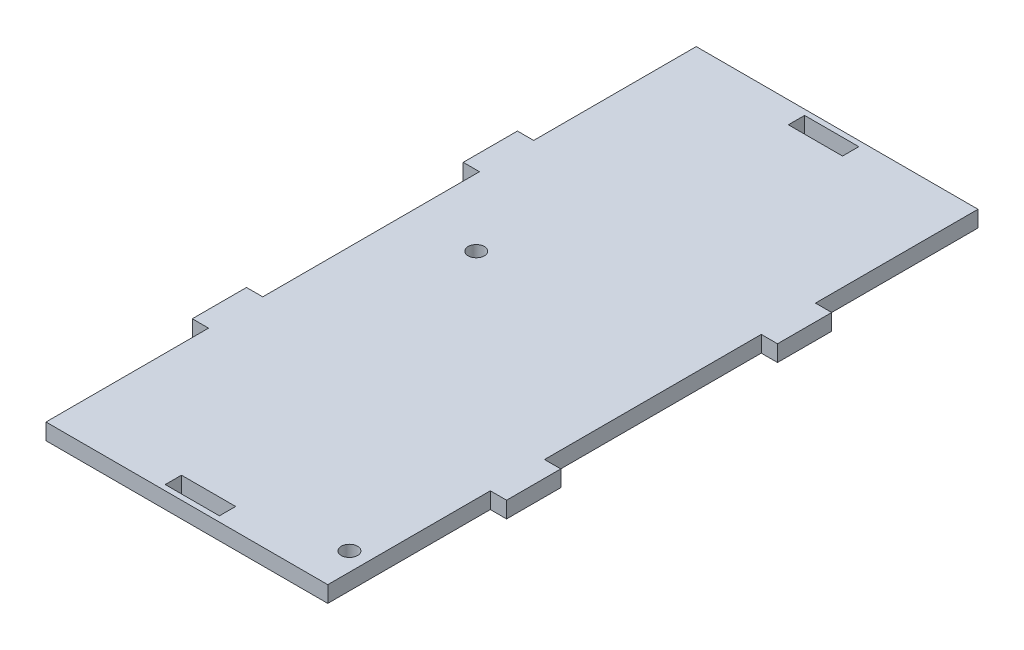
ISO-10303-21;
HEADER;
FILE_DESCRIPTION(('STEP AP214'),'2;1');
FILE_NAME('part.step','',(''),(''),'','','');
FILE_SCHEMA(('AUTOMOTIVE_DESIGN { 1 0 10303 214 1 1 1 1 }'));
ENDSEC;
DATA;
#1=APPLICATION_CONTEXT('core data for automotive mechanical design processes');
#2=APPLICATION_PROTOCOL_DEFINITION('international standard','automotive_design',2000,#1);
#3=PRODUCT_CONTEXT('',#1,'mechanical');
#4=PRODUCT('Part','Part','',(#3));
#5=PRODUCT_RELATED_PRODUCT_CATEGORY('part','',(#4));
#6=PRODUCT_DEFINITION_FORMATION('','',#4);
#7=PRODUCT_DEFINITION_CONTEXT('part definition',#1,'design');
#8=PRODUCT_DEFINITION('design','',#6,#7);
#9=PRODUCT_DEFINITION_SHAPE('','',#8);
#10=(LENGTH_UNIT() NAMED_UNIT(*) SI_UNIT(.MILLI.,.METRE.));
#11=(NAMED_UNIT(*) PLANE_ANGLE_UNIT() SI_UNIT($,.RADIAN.));
#12=(NAMED_UNIT(*) SI_UNIT($,.STERADIAN.) SOLID_ANGLE_UNIT());
#13=UNCERTAINTY_MEASURE_WITH_UNIT(LENGTH_MEASURE(1.E-05),#10,'distance_accuracy_value','');
#14=(GEOMETRIC_REPRESENTATION_CONTEXT(3) GLOBAL_UNCERTAINTY_ASSIGNED_CONTEXT((#13)) GLOBAL_UNIT_ASSIGNED_CONTEXT((#10,
#11,#12)) REPRESENTATION_CONTEXT('',''));
#15=CARTESIAN_POINT('',(0.,0.,0.));
#16=DIRECTION('',(0.,0.,1.));
#17=DIRECTION('',(1.,0.,0.));
#18=AXIS2_PLACEMENT_3D('',#15,#16,#17);
#19=CARTESIAN_POINT('',(0.,3.,0.));
#20=DIRECTION('',(0.,-1.,0.));
#21=DIRECTION('',(0.,0.,-1.));
#22=AXIS2_PLACEMENT_3D('',#19,#20,#21);
#23=PLANE('',#22);
#24=DIRECTION('',(0.,0.,1.));
#25=VECTOR('',#24,1.);
#26=CARTESIAN_POINT('',(-5.,3.,-59.));
#27=LINE('',#26,#25);
#28=CARTESIAN_POINT('',(-5.,3.,-59.));
#29=VERTEX_POINT('',#28);
#30=CARTESIAN_POINT('',(-5.,3.,-56.));
#31=VERTEX_POINT('',#30);
#32=EDGE_CURVE('E259',#29,#31,#27,.T.);
#33=ORIENTED_EDGE('',*,*,#32,.F.);
#34=DIRECTION('',(-1.,0.,0.));
#35=VECTOR('',#34,1.);
#36=CARTESIAN_POINT('',(5.,3.,-59.));
#37=LINE('',#36,#35);
#38=CARTESIAN_POINT('',(5.,3.,-59.));
#39=VERTEX_POINT('',#38);
#40=EDGE_CURVE('E267',#39,#29,#37,.T.);
#41=ORIENTED_EDGE('',*,*,#40,.F.);
#42=DIRECTION('',(0.,0.,-1.));
#43=VECTOR('',#42,1.);
#44=CARTESIAN_POINT('',(5.,3.,-59.));
#45=LINE('',#44,#43);
#46=CARTESIAN_POINT('',(5.,3.,-56.));
#47=VERTEX_POINT('',#46);
#48=EDGE_CURVE('E264',#47,#39,#45,.T.);
#49=ORIENTED_EDGE('',*,*,#48,.F.);
#50=DIRECTION('',(1.,0.,0.));
#51=VECTOR('',#50,1.);
#52=CARTESIAN_POINT('',(-5.,3.,-56.));
#53=LINE('',#52,#51);
#54=EDGE_CURVE('E261',#31,#47,#53,.T.);
#55=ORIENTED_EDGE('',*,*,#54,.F.);
#56=EDGE_LOOP('',(#33,#41,#49,#55));
#57=FACE_BOUND('',#56,.T.);
#58=DIRECTION('',(0.,0.,1.));
#59=VECTOR('',#58,1.);
#60=CARTESIAN_POINT('',(-26.,3.,-60.));
#61=LINE('',#60,#59);
#62=CARTESIAN_POINT('',(-26.,3.,-60.));
#63=VERTEX_POINT('',#62);
#64=CARTESIAN_POINT('',(-26.,3.,-30.));
#65=VERTEX_POINT('',#64);
#66=EDGE_CURVE('E290',#63,#65,#61,.T.);
#67=ORIENTED_EDGE('',*,*,#66,.T.);
#68=DIRECTION('',(-1.,0.,0.));
#69=VECTOR('',#68,1.);
#70=CARTESIAN_POINT('',(-26.,3.,-30.));
#71=LINE('',#70,#69);
#72=CARTESIAN_POINT('',(-29.,3.,-30.));
#73=VERTEX_POINT('',#72);
#74=EDGE_CURVE('E293',#65,#73,#71,.T.);
#75=ORIENTED_EDGE('',*,*,#74,.T.);
#76=DIRECTION('',(0.,0.,1.));
#77=VECTOR('',#76,1.);
#78=CARTESIAN_POINT('',(-29.,3.,-30.));
#79=LINE('',#78,#77);
#80=CARTESIAN_POINT('',(-29.,3.,-20.));
#81=VERTEX_POINT('',#80);
#82=EDGE_CURVE('E296',#73,#81,#79,.T.);
#83=ORIENTED_EDGE('',*,*,#82,.T.);
#84=DIRECTION('',(1.,0.,0.));
#85=VECTOR('',#84,1.);
#86=CARTESIAN_POINT('',(-26.,3.,-20.));
#87=LINE('',#86,#85);
#88=CARTESIAN_POINT('',(-26.,3.,-20.));
#89=VERTEX_POINT('',#88);
#90=EDGE_CURVE('E298',#81,#89,#87,.T.);
#91=ORIENTED_EDGE('',*,*,#90,.T.);
#92=DIRECTION('',(0.,0.,1.));
#93=VECTOR('',#92,1.);
#94=CARTESIAN_POINT('',(-26.,3.,20.));
#95=LINE('',#94,#93);
#96=CARTESIAN_POINT('',(-26.,3.,20.));
#97=VERTEX_POINT('',#96);
#98=EDGE_CURVE('E300',#89,#97,#95,.T.);
#99=ORIENTED_EDGE('',*,*,#98,.T.);
#100=DIRECTION('',(-1.,0.,0.));
#101=VECTOR('',#100,1.);
#102=CARTESIAN_POINT('',(-26.,3.,20.));
#103=LINE('',#102,#101);
#104=CARTESIAN_POINT('',(-29.,3.,20.));
#105=VERTEX_POINT('',#104);
#106=EDGE_CURVE('E302',#97,#105,#103,.T.);
#107=ORIENTED_EDGE('',*,*,#106,.T.);
#108=DIRECTION('',(0.,0.,1.));
#109=VECTOR('',#108,1.);
#110=CARTESIAN_POINT('',(-29.,3.,30.));
#111=LINE('',#110,#109);
#112=CARTESIAN_POINT('',(-29.,3.,30.));
#113=VERTEX_POINT('',#112);
#114=EDGE_CURVE('E304',#105,#113,#111,.T.);
#115=ORIENTED_EDGE('',*,*,#114,.T.);
#116=DIRECTION('',(1.,0.,0.));
#117=VECTOR('',#116,1.);
#118=CARTESIAN_POINT('',(-26.,3.,30.));
#119=LINE('',#118,#117);
#120=CARTESIAN_POINT('',(-26.,3.,30.));
#121=VERTEX_POINT('',#120);
#122=EDGE_CURVE('E306',#113,#121,#119,.T.);
#123=ORIENTED_EDGE('',*,*,#122,.T.);
#124=DIRECTION('',(0.,0.,1.));
#125=VECTOR('',#124,1.);
#126=CARTESIAN_POINT('',(-26.,3.,30.));
#127=LINE('',#126,#125);
#128=CARTESIAN_POINT('',(-26.,3.,60.));
#129=VERTEX_POINT('',#128);
#130=EDGE_CURVE('E308',#121,#129,#127,.T.);
#131=ORIENTED_EDGE('',*,*,#130,.T.);
#132=DIRECTION('',(1.,0.,0.));
#133=VECTOR('',#132,1.);
#134=CARTESIAN_POINT('',(-26.,3.,60.));
#135=LINE('',#134,#133);
#136=CARTESIAN_POINT('',(26.,3.,60.));
#137=VERTEX_POINT('',#136);
#138=EDGE_CURVE('E310',#129,#137,#135,.T.);
#139=ORIENTED_EDGE('',*,*,#138,.T.);
#140=DIRECTION('',(0.,0.,-1.));
#141=VECTOR('',#140,1.);
#142=CARTESIAN_POINT('',(26.,3.,30.));
#143=LINE('',#142,#141);
#144=CARTESIAN_POINT('',(26.,3.,30.));
#145=VERTEX_POINT('',#144);
#146=EDGE_CURVE('E312',#137,#145,#143,.T.);
#147=ORIENTED_EDGE('',*,*,#146,.T.);
#148=DIRECTION('',(1.,0.,0.));
#149=VECTOR('',#148,1.);
#150=CARTESIAN_POINT('',(26.,3.,30.));
#151=LINE('',#150,#149);
#152=CARTESIAN_POINT('',(29.,3.,30.));
#153=VERTEX_POINT('',#152);
#154=EDGE_CURVE('E314',#145,#153,#151,.T.);
#155=ORIENTED_EDGE('',*,*,#154,.T.);
#156=DIRECTION('',(0.,0.,-1.));
#157=VECTOR('',#156,1.);
#158=CARTESIAN_POINT('',(29.,3.,30.));
#159=LINE('',#158,#157);
#160=CARTESIAN_POINT('',(29.,3.,20.));
#161=VERTEX_POINT('',#160);
#162=EDGE_CURVE('E316',#153,#161,#159,.T.);
#163=ORIENTED_EDGE('',*,*,#162,.T.);
#164=DIRECTION('',(-1.,0.,0.));
#165=VECTOR('',#164,1.);
#166=CARTESIAN_POINT('',(26.,3.,20.));
#167=LINE('',#166,#165);
#168=CARTESIAN_POINT('',(26.,3.,20.));
#169=VERTEX_POINT('',#168);
#170=EDGE_CURVE('E318',#161,#169,#167,.T.);
#171=ORIENTED_EDGE('',*,*,#170,.T.);
#172=DIRECTION('',(0.,0.,-1.));
#173=VECTOR('',#172,1.);
#174=CARTESIAN_POINT('',(26.,3.,20.));
#175=LINE('',#174,#173);
#176=CARTESIAN_POINT('',(26.,3.,-20.));
#177=VERTEX_POINT('',#176);
#178=EDGE_CURVE('E320',#169,#177,#175,.T.);
#179=ORIENTED_EDGE('',*,*,#178,.T.);
#180=DIRECTION('',(1.,0.,0.));
#181=VECTOR('',#180,1.);
#182=CARTESIAN_POINT('',(26.,3.,-20.));
#183=LINE('',#182,#181);
#184=CARTESIAN_POINT('',(29.,3.,-20.));
#185=VERTEX_POINT('',#184);
#186=EDGE_CURVE('E322',#177,#185,#183,.T.);
#187=ORIENTED_EDGE('',*,*,#186,.T.);
#188=DIRECTION('',(0.,0.,-1.));
#189=VECTOR('',#188,1.);
#190=CARTESIAN_POINT('',(29.,3.,-30.));
#191=LINE('',#190,#189);
#192=CARTESIAN_POINT('',(29.,3.,-30.));
#193=VERTEX_POINT('',#192);
#194=EDGE_CURVE('E324',#185,#193,#191,.T.);
#195=ORIENTED_EDGE('',*,*,#194,.T.);
#196=DIRECTION('',(-1.,0.,0.));
#197=VECTOR('',#196,1.);
#198=CARTESIAN_POINT('',(26.,3.,-30.));
#199=LINE('',#198,#197);
#200=CARTESIAN_POINT('',(26.,3.,-30.));
#201=VERTEX_POINT('',#200);
#202=EDGE_CURVE('E326',#193,#201,#199,.T.);
#203=ORIENTED_EDGE('',*,*,#202,.T.);
#204=DIRECTION('',(0.,0.,-1.));
#205=VECTOR('',#204,1.);
#206=CARTESIAN_POINT('',(26.,3.,-60.));
#207=LINE('',#206,#205);
#208=CARTESIAN_POINT('',(26.,3.,-60.));
#209=VERTEX_POINT('',#208);
#210=EDGE_CURVE('E328',#201,#209,#207,.T.);
#211=ORIENTED_EDGE('',*,*,#210,.T.);
#212=DIRECTION('',(-1.,0.,0.));
#213=VECTOR('',#212,1.);
#214=CARTESIAN_POINT('',(-26.,3.,-60.));
#215=LINE('',#214,#213);
#216=EDGE_CURVE('E330',#209,#63,#215,.T.);
#217=ORIENTED_EDGE('',*,*,#216,.T.);
#218=EDGE_LOOP('',(#67,#75,#83,#91,#99,#107,#115,#123,#131,#139,#147,#155,#163,#171,#179,#187,
#195,#203,#211,#217));
#219=FACE_BOUND('',#218,.T.);
#220=DIRECTION('',(0.,0.,-1.));
#221=VECTOR('',#220,1.);
#222=CARTESIAN_POINT('',(5.,3.,59.));
#223=LINE('',#222,#221);
#224=CARTESIAN_POINT('',(5.,3.,59.));
#225=VERTEX_POINT('',#224);
#226=CARTESIAN_POINT('',(5.,3.,56.));
#227=VERTEX_POINT('',#226);
#228=EDGE_CURVE('E220',#225,#227,#223,.T.);
#229=ORIENTED_EDGE('',*,*,#228,.F.);
#230=DIRECTION('',(1.,0.,0.));
#231=VECTOR('',#230,1.);
#232=CARTESIAN_POINT('',(-5.,3.,59.));
#233=LINE('',#232,#231);
#234=CARTESIAN_POINT('',(-5.,3.,59.));
#235=VERTEX_POINT('',#234);
#236=EDGE_CURVE('E243',#235,#225,#233,.T.);
#237=ORIENTED_EDGE('',*,*,#236,.F.);
#238=DIRECTION('',(0.,0.,1.));
#239=VECTOR('',#238,1.);
#240=CARTESIAN_POINT('',(-5.,3.,59.));
#241=LINE('',#240,#239);
#242=CARTESIAN_POINT('',(-5.,3.,56.));
#243=VERTEX_POINT('',#242);
#244=EDGE_CURVE('E241',#243,#235,#241,.T.);
#245=ORIENTED_EDGE('',*,*,#244,.F.);
#246=DIRECTION('',(-1.,0.,0.));
#247=VECTOR('',#246,1.);
#248=CARTESIAN_POINT('',(-5.,3.,56.));
#249=LINE('',#248,#247);
#250=EDGE_CURVE('E228',#227,#243,#249,.T.);
#251=ORIENTED_EDGE('',*,*,#250,.F.);
#252=EDGE_LOOP('',(#229,#237,#245,#251));
#253=FACE_BOUND('',#252,.T.);
#254=CARTESIAN_POINT('',(22.6,3.,52.6));
#255=DIRECTION('',(0.,1.,0.));
#256=DIRECTION('',(0.,0.,1.));
#257=AXIS2_PLACEMENT_3D('',#254,#255,#256);
#258=CIRCLE('',#257,1.5);
#259=CARTESIAN_POINT('',(22.6,3.,54.1));
#260=VERTEX_POINT('',#259);
#261=EDGE_CURVE('E249',#260,#260,#258,.T.);
#262=ORIENTED_EDGE('',*,*,#261,.F.);
#263=EDGE_LOOP('',(#262));
#264=FACE_BOUND('',#263,.T.);
#265=CARTESIAN_POINT('',(-13.6,3.,-7.));
#266=DIRECTION('',(0.,1.,0.));
#267=DIRECTION('',(0.,0.,1.));
#268=AXIS2_PLACEMENT_3D('',#265,#266,#267);
#269=CIRCLE('',#268,1.5);
#270=CARTESIAN_POINT('',(-13.6,3.,-5.5));
#271=VERTEX_POINT('',#270);
#272=EDGE_CURVE('E801',#271,#271,#269,.T.);
#273=ORIENTED_EDGE('',*,*,#272,.F.);
#274=EDGE_LOOP('',(#273));
#275=FACE_BOUND('',#274,.T.);
#276=ADVANCED_FACE('F35',(#57,#219,#253,#264,#275),#23,.F.);
#277=CARTESIAN_POINT('',(0.,0.,0.));
#278=DIRECTION('',(0.,-1.,0.));
#279=DIRECTION('',(0.,0.,-1.));
#280=AXIS2_PLACEMENT_3D('',#277,#278,#279);
#281=PLANE('',#280);
#282=CARTESIAN_POINT('',(22.6,0.,52.6));
#283=DIRECTION('',(0.,1.,0.));
#284=DIRECTION('',(0.,0.,1.));
#285=AXIS2_PLACEMENT_3D('',#282,#283,#284);
#286=CIRCLE('',#285,1.5);
#287=CARTESIAN_POINT('',(22.6,0.,54.1));
#288=VERTEX_POINT('',#287);
#289=EDGE_CURVE('E807',#288,#288,#286,.T.);
#290=ORIENTED_EDGE('',*,*,#289,.T.);
#291=EDGE_LOOP('',(#290));
#292=FACE_BOUND('',#291,.T.);
#293=DIRECTION('',(0.,0.,1.));
#294=VECTOR('',#293,1.);
#295=CARTESIAN_POINT('',(-26.,0.,-60.));
#296=LINE('',#295,#294);
#297=CARTESIAN_POINT('',(-26.,0.,-60.));
#298=VERTEX_POINT('',#297);
#299=CARTESIAN_POINT('',(-26.,0.,-30.));
#300=VERTEX_POINT('',#299);
#301=EDGE_CURVE('E289',#298,#300,#296,.T.);
#302=ORIENTED_EDGE('',*,*,#301,.F.);
#303=DIRECTION('',(-1.,0.,0.));
#304=VECTOR('',#303,1.);
#305=CARTESIAN_POINT('',(-26.,0.,-60.));
#306=LINE('',#305,#304);
#307=CARTESIAN_POINT('',(26.,0.,-60.));
#308=VERTEX_POINT('',#307);
#309=EDGE_CURVE('E294',#308,#298,#306,.T.);
#310=ORIENTED_EDGE('',*,*,#309,.F.);
#311=DIRECTION('',(0.,0.,-1.));
#312=VECTOR('',#311,1.);
#313=CARTESIAN_POINT('',(26.,0.,-60.));
#314=LINE('',#313,#312);
#315=CARTESIAN_POINT('',(26.,0.,-30.));
#316=VERTEX_POINT('',#315);
#317=EDGE_CURVE('E369',#316,#308,#314,.T.);
#318=ORIENTED_EDGE('',*,*,#317,.F.);
#319=DIRECTION('',(-1.,0.,0.));
#320=VECTOR('',#319,1.);
#321=CARTESIAN_POINT('',(26.,0.,-30.));
#322=LINE('',#321,#320);
#323=CARTESIAN_POINT('',(29.,0.,-30.));
#324=VERTEX_POINT('',#323);
#325=EDGE_CURVE('E367',#324,#316,#322,.T.);
#326=ORIENTED_EDGE('',*,*,#325,.F.);
#327=DIRECTION('',(0.,0.,-1.));
#328=VECTOR('',#327,1.);
#329=CARTESIAN_POINT('',(29.,0.,-30.));
#330=LINE('',#329,#328);
#331=CARTESIAN_POINT('',(29.,0.,-20.));
#332=VERTEX_POINT('',#331);
#333=EDGE_CURVE('E365',#332,#324,#330,.T.);
#334=ORIENTED_EDGE('',*,*,#333,.F.);
#335=DIRECTION('',(1.,0.,0.));
#336=VECTOR('',#335,1.);
#337=CARTESIAN_POINT('',(26.,0.,-20.));
#338=LINE('',#337,#336);
#339=CARTESIAN_POINT('',(26.,0.,-20.));
#340=VERTEX_POINT('',#339);
#341=EDGE_CURVE('E363',#340,#332,#338,.T.);
#342=ORIENTED_EDGE('',*,*,#341,.F.);
#343=DIRECTION('',(0.,0.,-1.));
#344=VECTOR('',#343,1.);
#345=CARTESIAN_POINT('',(26.,0.,20.));
#346=LINE('',#345,#344);
#347=CARTESIAN_POINT('',(26.,0.,20.));
#348=VERTEX_POINT('',#347);
#349=EDGE_CURVE('E361',#348,#340,#346,.T.);
#350=ORIENTED_EDGE('',*,*,#349,.F.);
#351=DIRECTION('',(-1.,0.,0.));
#352=VECTOR('',#351,1.);
#353=CARTESIAN_POINT('',(26.,0.,20.));
#354=LINE('',#353,#352);
#355=CARTESIAN_POINT('',(29.,0.,20.));
#356=VERTEX_POINT('',#355);
#357=EDGE_CURVE('E359',#356,#348,#354,.T.);
#358=ORIENTED_EDGE('',*,*,#357,.F.);
#359=DIRECTION('',(0.,0.,-1.));
#360=VECTOR('',#359,1.);
#361=CARTESIAN_POINT('',(29.,0.,30.));
#362=LINE('',#361,#360);
#363=CARTESIAN_POINT('',(29.,0.,30.));
#364=VERTEX_POINT('',#363);
#365=EDGE_CURVE('E357',#364,#356,#362,.T.);
#366=ORIENTED_EDGE('',*,*,#365,.F.);
#367=DIRECTION('',(1.,0.,0.));
#368=VECTOR('',#367,1.);
#369=CARTESIAN_POINT('',(26.,0.,30.));
#370=LINE('',#369,#368);
#371=CARTESIAN_POINT('',(26.,0.,30.));
#372=VERTEX_POINT('',#371);
#373=EDGE_CURVE('E355',#372,#364,#370,.T.);
#374=ORIENTED_EDGE('',*,*,#373,.F.);
#375=DIRECTION('',(0.,0.,-1.));
#376=VECTOR('',#375,1.);
#377=CARTESIAN_POINT('',(26.,0.,30.));
#378=LINE('',#377,#376);
#379=CARTESIAN_POINT('',(26.,0.,60.));
#380=VERTEX_POINT('',#379);
#381=EDGE_CURVE('E353',#380,#372,#378,.T.);
#382=ORIENTED_EDGE('',*,*,#381,.F.);
#383=DIRECTION('',(1.,0.,0.));
#384=VECTOR('',#383,1.);
#385=CARTESIAN_POINT('',(-26.,0.,60.));
#386=LINE('',#385,#384);
#387=CARTESIAN_POINT('',(-26.,0.,60.));
#388=VERTEX_POINT('',#387);
#389=EDGE_CURVE('E351',#388,#380,#386,.T.);
#390=ORIENTED_EDGE('',*,*,#389,.F.);
#391=DIRECTION('',(0.,0.,1.));
#392=VECTOR('',#391,1.);
#393=CARTESIAN_POINT('',(-26.,0.,30.));
#394=LINE('',#393,#392);
#395=CARTESIAN_POINT('',(-26.,0.,30.));
#396=VERTEX_POINT('',#395);
#397=EDGE_CURVE('E349',#396,#388,#394,.T.);
#398=ORIENTED_EDGE('',*,*,#397,.F.);
#399=DIRECTION('',(1.,0.,0.));
#400=VECTOR('',#399,1.);
#401=CARTESIAN_POINT('',(-26.,0.,30.));
#402=LINE('',#401,#400);
#403=CARTESIAN_POINT('',(-29.,0.,30.));
#404=VERTEX_POINT('',#403);
#405=EDGE_CURVE('E347',#404,#396,#402,.T.);
#406=ORIENTED_EDGE('',*,*,#405,.F.);
#407=DIRECTION('',(0.,0.,1.));
#408=VECTOR('',#407,1.);
#409=CARTESIAN_POINT('',(-29.,0.,30.));
#410=LINE('',#409,#408);
#411=CARTESIAN_POINT('',(-29.,0.,20.));
#412=VERTEX_POINT('',#411);
#413=EDGE_CURVE('E345',#412,#404,#410,.T.);
#414=ORIENTED_EDGE('',*,*,#413,.F.);
#415=DIRECTION('',(-1.,0.,0.));
#416=VECTOR('',#415,1.);
#417=CARTESIAN_POINT('',(-26.,0.,20.));
#418=LINE('',#417,#416);
#419=CARTESIAN_POINT('',(-26.,0.,20.));
#420=VERTEX_POINT('',#419);
#421=EDGE_CURVE('E343',#420,#412,#418,.T.);
#422=ORIENTED_EDGE('',*,*,#421,.F.);
#423=DIRECTION('',(0.,0.,1.));
#424=VECTOR('',#423,1.);
#425=CARTESIAN_POINT('',(-26.,0.,20.));
#426=LINE('',#425,#424);
#427=CARTESIAN_POINT('',(-26.,0.,-20.));
#428=VERTEX_POINT('',#427);
#429=EDGE_CURVE('E341',#428,#420,#426,.T.);
#430=ORIENTED_EDGE('',*,*,#429,.F.);
#431=DIRECTION('',(1.,0.,0.));
#432=VECTOR('',#431,1.);
#433=CARTESIAN_POINT('',(-26.,0.,-20.));
#434=LINE('',#433,#432);
#435=CARTESIAN_POINT('',(-29.,0.,-20.));
#436=VERTEX_POINT('',#435);
#437=EDGE_CURVE('E339',#436,#428,#434,.T.);
#438=ORIENTED_EDGE('',*,*,#437,.F.);
#439=DIRECTION('',(0.,0.,1.));
#440=VECTOR('',#439,1.);
#441=CARTESIAN_POINT('',(-29.,0.,-30.));
#442=LINE('',#441,#440);
#443=CARTESIAN_POINT('',(-29.,0.,-30.));
#444=VERTEX_POINT('',#443);
#445=EDGE_CURVE('E337',#444,#436,#442,.T.);
#446=ORIENTED_EDGE('',*,*,#445,.F.);
#447=DIRECTION('',(-1.,0.,0.));
#448=VECTOR('',#447,1.);
#449=CARTESIAN_POINT('',(-26.,0.,-30.));
#450=LINE('',#449,#448);
#451=EDGE_CURVE('E335',#300,#444,#450,.T.);
#452=ORIENTED_EDGE('',*,*,#451,.F.);
#453=EDGE_LOOP('',(#302,#310,#318,#326,#334,#342,#350,#358,#366,#374,#382,#390,#398,#406,#414,
#422,#430,#438,#446,#452));
#454=FACE_BOUND('',#453,.T.);
#455=DIRECTION('',(-1.,0.,0.));
#456=VECTOR('',#455,1.);
#457=CARTESIAN_POINT('',(5.,0.,-59.));
#458=LINE('',#457,#456);
#459=CARTESIAN_POINT('',(5.,0.,-59.));
#460=VERTEX_POINT('',#459);
#461=CARTESIAN_POINT('',(-5.,0.,-59.));
#462=VERTEX_POINT('',#461);
#463=EDGE_CURVE('E262',#460,#462,#458,.T.);
#464=ORIENTED_EDGE('',*,*,#463,.T.);
#465=DIRECTION('',(0.,0.,1.));
#466=VECTOR('',#465,1.);
#467=CARTESIAN_POINT('',(-5.,0.,-59.));
#468=LINE('',#467,#466);
#469=CARTESIAN_POINT('',(-5.,0.,-56.));
#470=VERTEX_POINT('',#469);
#471=EDGE_CURVE('E236',#462,#470,#468,.T.);
#472=ORIENTED_EDGE('',*,*,#471,.T.);
#473=DIRECTION('',(1.,0.,0.));
#474=VECTOR('',#473,1.);
#475=CARTESIAN_POINT('',(-5.,0.,-56.));
#476=LINE('',#475,#474);
#477=CARTESIAN_POINT('',(5.,0.,-56.));
#478=VERTEX_POINT('',#477);
#479=EDGE_CURVE('E272',#470,#478,#476,.T.);
#480=ORIENTED_EDGE('',*,*,#479,.T.);
#481=DIRECTION('',(0.,0.,-1.));
#482=VECTOR('',#481,1.);
#483=CARTESIAN_POINT('',(5.,0.,-59.));
#484=LINE('',#483,#482);
#485=EDGE_CURVE('E275',#478,#460,#484,.T.);
#486=ORIENTED_EDGE('',*,*,#485,.T.);
#487=EDGE_LOOP('',(#464,#472,#480,#486));
#488=FACE_BOUND('',#487,.T.);
#489=DIRECTION('',(1.,0.,0.));
#490=VECTOR('',#489,1.);
#491=CARTESIAN_POINT('',(-5.,0.,59.));
#492=LINE('',#491,#490);
#493=CARTESIAN_POINT('',(-5.,0.,59.));
#494=VERTEX_POINT('',#493);
#495=CARTESIAN_POINT('',(5.,0.,59.));
#496=VERTEX_POINT('',#495);
#497=EDGE_CURVE('E229',#494,#496,#492,.T.);
#498=ORIENTED_EDGE('',*,*,#497,.T.);
#499=DIRECTION('',(0.,0.,-1.));
#500=VECTOR('',#499,1.);
#501=CARTESIAN_POINT('',(5.,0.,59.));
#502=LINE('',#501,#500);
#503=CARTESIAN_POINT('',(5.,0.,56.));
#504=VERTEX_POINT('',#503);
#505=EDGE_CURVE('E58',#496,#504,#502,.T.);
#506=ORIENTED_EDGE('',*,*,#505,.T.);
#507=DIRECTION('',(-1.,0.,0.));
#508=VECTOR('',#507,1.);
#509=CARTESIAN_POINT('',(-5.,0.,56.));
#510=LINE('',#509,#508);
#511=CARTESIAN_POINT('',(-5.,0.,56.));
#512=VERTEX_POINT('',#511);
#513=EDGE_CURVE('E235',#504,#512,#510,.T.);
#514=ORIENTED_EDGE('',*,*,#513,.T.);
#515=DIRECTION('',(0.,0.,1.));
#516=VECTOR('',#515,1.);
#517=CARTESIAN_POINT('',(-5.,0.,59.));
#518=LINE('',#517,#516);
#519=EDGE_CURVE('E251',#512,#494,#518,.T.);
#520=ORIENTED_EDGE('',*,*,#519,.T.);
#521=EDGE_LOOP('',(#498,#506,#514,#520));
#522=FACE_BOUND('',#521,.T.);
#523=CARTESIAN_POINT('',(-13.6,0.,-7.));
#524=DIRECTION('',(0.,1.,0.));
#525=DIRECTION('',(0.,0.,1.));
#526=AXIS2_PLACEMENT_3D('',#523,#524,#525);
#527=CIRCLE('',#526,1.5);
#528=CARTESIAN_POINT('',(-13.6,0.,-5.5));
#529=VERTEX_POINT('',#528);
#530=EDGE_CURVE('E804',#529,#529,#527,.T.);
#531=ORIENTED_EDGE('',*,*,#530,.T.);
#532=EDGE_LOOP('',(#531));
#533=FACE_BOUND('',#532,.T.);
#534=ADVANCED_FACE('F435',(#292,#454,#488,#522,#533),#281,.T.);
#535=CARTESIAN_POINT('',(-26.,3.,-60.));
#536=DIRECTION('',(1.,0.,0.));
#537=DIRECTION('',(0.,0.,-1.));
#538=AXIS2_PLACEMENT_3D('',#535,#536,#537);
#539=PLANE('',#538);
#540=ORIENTED_EDGE('',*,*,#301,.T.);
#541=DIRECTION('',(0.,-1.,0.));
#542=VECTOR('',#541,1.);
#543=CARTESIAN_POINT('',(-26.,3.,-30.));
#544=LINE('',#543,#542);
#545=EDGE_CURVE('E11',#65,#300,#544,.T.);
#546=ORIENTED_EDGE('',*,*,#545,.F.);
#547=ORIENTED_EDGE('',*,*,#66,.F.);
#548=DIRECTION('',(0.,-1.,0.));
#549=VECTOR('',#548,1.);
#550=CARTESIAN_POINT('',(-26.,3.,-60.));
#551=LINE('',#550,#549);
#552=EDGE_CURVE('E332',#63,#298,#551,.T.);
#553=ORIENTED_EDGE('',*,*,#552,.T.);
#554=EDGE_LOOP('',(#540,#546,#547,#553));
#555=FACE_BOUND('',#554,.T.);
#556=ADVANCED_FACE('F37',(#555),#539,.F.);
#557=CARTESIAN_POINT('',(-26.,3.,-30.));
#558=DIRECTION('',(0.,0.,1.));
#559=DIRECTION('',(1.,0.,0.));
#560=AXIS2_PLACEMENT_3D('',#557,#558,#559);
#561=PLANE('',#560);
#562=ORIENTED_EDGE('',*,*,#451,.T.);
#563=DIRECTION('',(0.,-1.,0.));
#564=VECTOR('',#563,1.);
#565=CARTESIAN_POINT('',(-29.,3.,-30.));
#566=LINE('',#565,#564);
#567=EDGE_CURVE('E43',#73,#444,#566,.T.);
#568=ORIENTED_EDGE('',*,*,#567,.F.);
#569=ORIENTED_EDGE('',*,*,#74,.F.);
#570=ORIENTED_EDGE('',*,*,#545,.T.);
#571=EDGE_LOOP('',(#562,#568,#569,#570));
#572=FACE_BOUND('',#571,.T.);
#573=ADVANCED_FACE('F452',(#572),#561,.F.);
#574=CARTESIAN_POINT('',(-29.,3.,-30.));
#575=DIRECTION('',(1.,0.,0.));
#576=DIRECTION('',(0.,0.,-1.));
#577=AXIS2_PLACEMENT_3D('',#574,#575,#576);
#578=PLANE('',#577);
#579=ORIENTED_EDGE('',*,*,#445,.T.);
#580=DIRECTION('',(0.,-1.,0.));
#581=VECTOR('',#580,1.);
#582=CARTESIAN_POINT('',(-29.,3.,-20.));
#583=LINE('',#582,#581);
#584=EDGE_CURVE('E422',#81,#436,#583,.T.);
#585=ORIENTED_EDGE('',*,*,#584,.F.);
#586=ORIENTED_EDGE('',*,*,#82,.F.);
#587=ORIENTED_EDGE('',*,*,#567,.T.);
#588=EDGE_LOOP('',(#579,#585,#586,#587));
#589=FACE_BOUND('',#588,.T.);
#590=ADVANCED_FACE('F429',(#589),#578,.F.);
#591=CARTESIAN_POINT('',(-26.,3.,-20.));
#592=DIRECTION('',(0.,0.,-1.));
#593=DIRECTION('',(-1.,0.,0.));
#594=AXIS2_PLACEMENT_3D('',#591,#592,#593);
#595=PLANE('',#594);
#596=ORIENTED_EDGE('',*,*,#437,.T.);
#597=DIRECTION('',(0.,-1.,0.));
#598=VECTOR('',#597,1.);
#599=CARTESIAN_POINT('',(-26.,3.,-20.));
#600=LINE('',#599,#598);
#601=EDGE_CURVE('E419',#89,#428,#600,.T.);
#602=ORIENTED_EDGE('',*,*,#601,.F.);
#603=ORIENTED_EDGE('',*,*,#90,.F.);
#604=ORIENTED_EDGE('',*,*,#584,.T.);
#605=EDGE_LOOP('',(#596,#602,#603,#604));
#606=FACE_BOUND('',#605,.T.);
#607=ADVANCED_FACE('F441',(#606),#595,.F.);
#608=CARTESIAN_POINT('',(-26.,3.,20.));
#609=DIRECTION('',(1.,0.,0.));
#610=DIRECTION('',(0.,0.,-1.));
#611=AXIS2_PLACEMENT_3D('',#608,#609,#610);
#612=PLANE('',#611);
#613=ORIENTED_EDGE('',*,*,#429,.T.);
#614=DIRECTION('',(0.,-1.,0.));
#615=VECTOR('',#614,1.);
#616=CARTESIAN_POINT('',(-26.,3.,20.));
#617=LINE('',#616,#615);
#618=EDGE_CURVE('E416',#97,#420,#617,.T.);
#619=ORIENTED_EDGE('',*,*,#618,.F.);
#620=ORIENTED_EDGE('',*,*,#98,.F.);
#621=ORIENTED_EDGE('',*,*,#601,.T.);
#622=EDGE_LOOP('',(#613,#619,#620,#621));
#623=FACE_BOUND('',#622,.T.);
#624=ADVANCED_FACE('F445',(#623),#612,.F.);
#625=CARTESIAN_POINT('',(-26.,3.,20.));
#626=DIRECTION('',(0.,0.,1.));
#627=DIRECTION('',(1.,0.,0.));
#628=AXIS2_PLACEMENT_3D('',#625,#626,#627);
#629=PLANE('',#628);
#630=ORIENTED_EDGE('',*,*,#421,.T.);
#631=DIRECTION('',(0.,-1.,0.));
#632=VECTOR('',#631,1.);
#633=CARTESIAN_POINT('',(-29.,3.,20.));
#634=LINE('',#633,#632);
#635=EDGE_CURVE('E413',#105,#412,#634,.T.);
#636=ORIENTED_EDGE('',*,*,#635,.F.);
#637=ORIENTED_EDGE('',*,*,#106,.F.);
#638=ORIENTED_EDGE('',*,*,#618,.T.);
#639=EDGE_LOOP('',(#630,#636,#637,#638));
#640=FACE_BOUND('',#639,.T.);
#641=ADVANCED_FACE('F525',(#640),#629,.F.);
#642=CARTESIAN_POINT('',(-29.,3.,30.));
#643=DIRECTION('',(1.,0.,0.));
#644=DIRECTION('',(0.,0.,-1.));
#645=AXIS2_PLACEMENT_3D('',#642,#643,#644);
#646=PLANE('',#645);
#647=ORIENTED_EDGE('',*,*,#413,.T.);
#648=DIRECTION('',(0.,-1.,0.));
#649=VECTOR('',#648,1.);
#650=CARTESIAN_POINT('',(-29.,3.,30.));
#651=LINE('',#650,#649);
#652=EDGE_CURVE('E410',#113,#404,#651,.T.);
#653=ORIENTED_EDGE('',*,*,#652,.F.);
#654=ORIENTED_EDGE('',*,*,#114,.F.);
#655=ORIENTED_EDGE('',*,*,#635,.T.);
#656=EDGE_LOOP('',(#647,#653,#654,#655));
#657=FACE_BOUND('',#656,.T.);
#658=ADVANCED_FACE('F523',(#657),#646,.F.);
#659=CARTESIAN_POINT('',(-26.,3.,30.));
#660=DIRECTION('',(0.,0.,-1.));
#661=DIRECTION('',(-1.,0.,0.));
#662=AXIS2_PLACEMENT_3D('',#659,#660,#661);
#663=PLANE('',#662);
#664=ORIENTED_EDGE('',*,*,#405,.T.);
#665=DIRECTION('',(0.,-1.,0.));
#666=VECTOR('',#665,1.);
#667=CARTESIAN_POINT('',(-26.,3.,30.));
#668=LINE('',#667,#666);
#669=EDGE_CURVE('E407',#121,#396,#668,.T.);
#670=ORIENTED_EDGE('',*,*,#669,.F.);
#671=ORIENTED_EDGE('',*,*,#122,.F.);
#672=ORIENTED_EDGE('',*,*,#652,.T.);
#673=EDGE_LOOP('',(#664,#670,#671,#672));
#674=FACE_BOUND('',#673,.T.);
#675=ADVANCED_FACE('F518',(#674),#663,.F.);
#676=CARTESIAN_POINT('',(-26.,3.,30.));
#677=DIRECTION('',(1.,0.,0.));
#678=DIRECTION('',(0.,0.,-1.));
#679=AXIS2_PLACEMENT_3D('',#676,#677,#678);
#680=PLANE('',#679);
#681=ORIENTED_EDGE('',*,*,#397,.T.);
#682=DIRECTION('',(0.,-1.,0.));
#683=VECTOR('',#682,1.);
#684=CARTESIAN_POINT('',(-26.,3.,60.));
#685=LINE('',#684,#683);
#686=EDGE_CURVE('E404',#129,#388,#685,.T.);
#687=ORIENTED_EDGE('',*,*,#686,.F.);
#688=ORIENTED_EDGE('',*,*,#130,.F.);
#689=ORIENTED_EDGE('',*,*,#669,.T.);
#690=EDGE_LOOP('',(#681,#687,#688,#689));
#691=FACE_BOUND('',#690,.T.);
#692=ADVANCED_FACE('F513',(#691),#680,.F.);
#693=CARTESIAN_POINT('',(-26.,3.,60.));
#694=DIRECTION('',(0.,0.,-1.));
#695=DIRECTION('',(-1.,0.,0.));
#696=AXIS2_PLACEMENT_3D('',#693,#694,#695);
#697=PLANE('',#696);
#698=ORIENTED_EDGE('',*,*,#389,.T.);
#699=DIRECTION('',(0.,-1.,0.));
#700=VECTOR('',#699,1.);
#701=CARTESIAN_POINT('',(26.,3.,60.));
#702=LINE('',#701,#700);
#703=EDGE_CURVE('E401',#137,#380,#702,.T.);
#704=ORIENTED_EDGE('',*,*,#703,.F.);
#705=ORIENTED_EDGE('',*,*,#138,.F.);
#706=ORIENTED_EDGE('',*,*,#686,.T.);
#707=EDGE_LOOP('',(#698,#704,#705,#706));
#708=FACE_BOUND('',#707,.T.);
#709=ADVANCED_FACE('F509',(#708),#697,.F.);
#710=CARTESIAN_POINT('',(26.,3.,30.));
#711=DIRECTION('',(-1.,0.,0.));
#712=DIRECTION('',(0.,0.,1.));
#713=AXIS2_PLACEMENT_3D('',#710,#711,#712);
#714=PLANE('',#713);
#715=ORIENTED_EDGE('',*,*,#381,.T.);
#716=DIRECTION('',(0.,-1.,0.));
#717=VECTOR('',#716,1.);
#718=CARTESIAN_POINT('',(26.,3.,30.));
#719=LINE('',#718,#717);
#720=EDGE_CURVE('E398',#145,#372,#719,.T.);
#721=ORIENTED_EDGE('',*,*,#720,.F.);
#722=ORIENTED_EDGE('',*,*,#146,.F.);
#723=ORIENTED_EDGE('',*,*,#703,.T.);
#724=EDGE_LOOP('',(#715,#721,#722,#723));
#725=FACE_BOUND('',#724,.T.);
#726=ADVANCED_FACE('F504',(#725),#714,.F.);
#727=CARTESIAN_POINT('',(26.,3.,30.));
#728=DIRECTION('',(0.,0.,-1.));
#729=DIRECTION('',(-1.,0.,0.));
#730=AXIS2_PLACEMENT_3D('',#727,#728,#729);
#731=PLANE('',#730);
#732=ORIENTED_EDGE('',*,*,#373,.T.);
#733=DIRECTION('',(0.,-1.,0.));
#734=VECTOR('',#733,1.);
#735=CARTESIAN_POINT('',(29.,3.,30.));
#736=LINE('',#735,#734);
#737=EDGE_CURVE('E395',#153,#364,#736,.T.);
#738=ORIENTED_EDGE('',*,*,#737,.F.);
#739=ORIENTED_EDGE('',*,*,#154,.F.);
#740=ORIENTED_EDGE('',*,*,#720,.T.);
#741=EDGE_LOOP('',(#732,#738,#739,#740));
#742=FACE_BOUND('',#741,.T.);
#743=ADVANCED_FACE('F498',(#742),#731,.F.);
#744=CARTESIAN_POINT('',(29.,3.,30.));
#745=DIRECTION('',(-1.,0.,0.));
#746=DIRECTION('',(0.,0.,1.));
#747=AXIS2_PLACEMENT_3D('',#744,#745,#746);
#748=PLANE('',#747);
#749=ORIENTED_EDGE('',*,*,#365,.T.);
#750=DIRECTION('',(0.,-1.,0.));
#751=VECTOR('',#750,1.);
#752=CARTESIAN_POINT('',(29.,3.,20.));
#753=LINE('',#752,#751);
#754=EDGE_CURVE('E392',#161,#356,#753,.T.);
#755=ORIENTED_EDGE('',*,*,#754,.F.);
#756=ORIENTED_EDGE('',*,*,#162,.F.);
#757=ORIENTED_EDGE('',*,*,#737,.T.);
#758=EDGE_LOOP('',(#749,#755,#756,#757));
#759=FACE_BOUND('',#758,.T.);
#760=ADVANCED_FACE('F494',(#759),#748,.F.);
#761=CARTESIAN_POINT('',(26.,3.,20.));
#762=DIRECTION('',(0.,0.,1.));
#763=DIRECTION('',(1.,0.,0.));
#764=AXIS2_PLACEMENT_3D('',#761,#762,#763);
#765=PLANE('',#764);
#766=ORIENTED_EDGE('',*,*,#357,.T.);
#767=DIRECTION('',(0.,-1.,0.));
#768=VECTOR('',#767,1.);
#769=CARTESIAN_POINT('',(26.,3.,20.));
#770=LINE('',#769,#768);
#771=EDGE_CURVE('E389',#169,#348,#770,.T.);
#772=ORIENTED_EDGE('',*,*,#771,.F.);
#773=ORIENTED_EDGE('',*,*,#170,.F.);
#774=ORIENTED_EDGE('',*,*,#754,.T.);
#775=EDGE_LOOP('',(#766,#772,#773,#774));
#776=FACE_BOUND('',#775,.T.);
#777=ADVANCED_FACE('F489',(#776),#765,.F.);
#778=CARTESIAN_POINT('',(26.,3.,20.));
#779=DIRECTION('',(-1.,0.,0.));
#780=DIRECTION('',(0.,0.,1.));
#781=AXIS2_PLACEMENT_3D('',#778,#779,#780);
#782=PLANE('',#781);
#783=ORIENTED_EDGE('',*,*,#349,.T.);
#784=DIRECTION('',(0.,-1.,0.));
#785=VECTOR('',#784,1.);
#786=CARTESIAN_POINT('',(26.,3.,-20.));
#787=LINE('',#786,#785);
#788=EDGE_CURVE('E386',#177,#340,#787,.T.);
#789=ORIENTED_EDGE('',*,*,#788,.F.);
#790=ORIENTED_EDGE('',*,*,#178,.F.);
#791=ORIENTED_EDGE('',*,*,#771,.T.);
#792=EDGE_LOOP('',(#783,#789,#790,#791));
#793=FACE_BOUND('',#792,.T.);
#794=ADVANCED_FACE('F483',(#793),#782,.F.);
#795=CARTESIAN_POINT('',(26.,3.,-20.));
#796=DIRECTION('',(0.,0.,-1.));
#797=DIRECTION('',(-1.,0.,0.));
#798=AXIS2_PLACEMENT_3D('',#795,#796,#797);
#799=PLANE('',#798);
#800=ORIENTED_EDGE('',*,*,#341,.T.);
#801=DIRECTION('',(0.,-1.,0.));
#802=VECTOR('',#801,1.);
#803=CARTESIAN_POINT('',(29.,3.,-20.));
#804=LINE('',#803,#802);
#805=EDGE_CURVE('E383',#185,#332,#804,.T.);
#806=ORIENTED_EDGE('',*,*,#805,.F.);
#807=ORIENTED_EDGE('',*,*,#186,.F.);
#808=ORIENTED_EDGE('',*,*,#788,.T.);
#809=EDGE_LOOP('',(#800,#806,#807,#808));
#810=FACE_BOUND('',#809,.T.);
#811=ADVANCED_FACE('F479',(#810),#799,.F.);
#812=CARTESIAN_POINT('',(29.,3.,-30.));
#813=DIRECTION('',(-1.,0.,0.));
#814=DIRECTION('',(0.,0.,1.));
#815=AXIS2_PLACEMENT_3D('',#812,#813,#814);
#816=PLANE('',#815);
#817=ORIENTED_EDGE('',*,*,#333,.T.);
#818=DIRECTION('',(0.,-1.,0.));
#819=VECTOR('',#818,1.);
#820=CARTESIAN_POINT('',(29.,3.,-30.));
#821=LINE('',#820,#819);
#822=EDGE_CURVE('E380',#193,#324,#821,.T.);
#823=ORIENTED_EDGE('',*,*,#822,.F.);
#824=ORIENTED_EDGE('',*,*,#194,.F.);
#825=ORIENTED_EDGE('',*,*,#805,.T.);
#826=EDGE_LOOP('',(#817,#823,#824,#825));
#827=FACE_BOUND('',#826,.T.);
#828=ADVANCED_FACE('F474',(#827),#816,.F.);
#829=CARTESIAN_POINT('',(26.,3.,-30.));
#830=DIRECTION('',(0.,0.,1.));
#831=DIRECTION('',(1.,0.,0.));
#832=AXIS2_PLACEMENT_3D('',#829,#830,#831);
#833=PLANE('',#832);
#834=ORIENTED_EDGE('',*,*,#325,.T.);
#835=DIRECTION('',(0.,-1.,0.));
#836=VECTOR('',#835,1.);
#837=CARTESIAN_POINT('',(26.,3.,-30.));
#838=LINE('',#837,#836);
#839=EDGE_CURVE('E377',#201,#316,#838,.T.);
#840=ORIENTED_EDGE('',*,*,#839,.F.);
#841=ORIENTED_EDGE('',*,*,#202,.F.);
#842=ORIENTED_EDGE('',*,*,#822,.T.);
#843=EDGE_LOOP('',(#834,#840,#841,#842));
#844=FACE_BOUND('',#843,.T.);
#845=ADVANCED_FACE('F468',(#844),#833,.F.);
#846=CARTESIAN_POINT('',(26.,3.,-60.));
#847=DIRECTION('',(-1.,0.,0.));
#848=DIRECTION('',(0.,0.,1.));
#849=AXIS2_PLACEMENT_3D('',#846,#847,#848);
#850=PLANE('',#849);
#851=ORIENTED_EDGE('',*,*,#317,.T.);
#852=DIRECTION('',(0.,-1.,0.));
#853=VECTOR('',#852,1.);
#854=CARTESIAN_POINT('',(26.,3.,-60.));
#855=LINE('',#854,#853);
#856=EDGE_CURVE('E374',#209,#308,#855,.T.);
#857=ORIENTED_EDGE('',*,*,#856,.F.);
#858=ORIENTED_EDGE('',*,*,#210,.F.);
#859=ORIENTED_EDGE('',*,*,#839,.T.);
#860=EDGE_LOOP('',(#851,#857,#858,#859));
#861=FACE_BOUND('',#860,.T.);
#862=ADVANCED_FACE('F464',(#861),#850,.F.);
#863=CARTESIAN_POINT('',(-26.,3.,-60.));
#864=DIRECTION('',(0.,0.,1.));
#865=DIRECTION('',(1.,0.,0.));
#866=AXIS2_PLACEMENT_3D('',#863,#864,#865);
#867=PLANE('',#866);
#868=ORIENTED_EDGE('',*,*,#309,.T.);
#869=ORIENTED_EDGE('',*,*,#552,.F.);
#870=ORIENTED_EDGE('',*,*,#216,.F.);
#871=ORIENTED_EDGE('',*,*,#856,.T.);
#872=EDGE_LOOP('',(#868,#869,#870,#871));
#873=FACE_BOUND('',#872,.T.);
#874=ADVANCED_FACE('F459',(#873),#867,.F.);
#875=CARTESIAN_POINT('',(-5.,3.,-59.));
#876=DIRECTION('',(1.,0.,0.));
#877=DIRECTION('',(0.,0.,-1.));
#878=AXIS2_PLACEMENT_3D('',#875,#876,#877);
#879=PLANE('',#878);
#880=ORIENTED_EDGE('',*,*,#471,.F.);
#881=DIRECTION('',(0.,-1.,0.));
#882=VECTOR('',#881,1.);
#883=CARTESIAN_POINT('',(-5.,3.,-59.));
#884=LINE('',#883,#882);
#885=EDGE_CURVE('E269',#29,#462,#884,.T.);
#886=ORIENTED_EDGE('',*,*,#885,.F.);
#887=ORIENTED_EDGE('',*,*,#32,.T.);
#888=DIRECTION('',(0.,-1.,0.));
#889=VECTOR('',#888,1.);
#890=CARTESIAN_POINT('',(-5.,3.,-56.));
#891=LINE('',#890,#889);
#892=EDGE_CURVE('E286',#31,#470,#891,.T.);
#893=ORIENTED_EDGE('',*,*,#892,.T.);
#894=EDGE_LOOP('',(#880,#886,#887,#893));
#895=FACE_BOUND('',#894,.T.);
#896=ADVANCED_FACE('F544',(#895),#879,.T.);
#897=CARTESIAN_POINT('',(-5.,3.,-56.));
#898=DIRECTION('',(0.,0.,-1.));
#899=DIRECTION('',(-1.,0.,0.));
#900=AXIS2_PLACEMENT_3D('',#897,#898,#899);
#901=PLANE('',#900);
#902=ORIENTED_EDGE('',*,*,#479,.F.);
#903=ORIENTED_EDGE('',*,*,#892,.F.);
#904=ORIENTED_EDGE('',*,*,#54,.T.);
#905=DIRECTION('',(0.,-1.,0.));
#906=VECTOR('',#905,1.);
#907=CARTESIAN_POINT('',(5.,3.,-56.));
#908=LINE('',#907,#906);
#909=EDGE_CURVE('E284',#47,#478,#908,.T.);
#910=ORIENTED_EDGE('',*,*,#909,.T.);
#911=EDGE_LOOP('',(#902,#903,#904,#910));
#912=FACE_BOUND('',#911,.T.);
#913=ADVANCED_FACE('F630',(#912),#901,.T.);
#914=CARTESIAN_POINT('',(5.,3.,-59.));
#915=DIRECTION('',(-1.,0.,0.));
#916=DIRECTION('',(0.,0.,1.));
#917=AXIS2_PLACEMENT_3D('',#914,#915,#916);
#918=PLANE('',#917);
#919=ORIENTED_EDGE('',*,*,#485,.F.);
#920=ORIENTED_EDGE('',*,*,#909,.F.);
#921=ORIENTED_EDGE('',*,*,#48,.T.);
#922=DIRECTION('',(0.,-1.,0.));
#923=VECTOR('',#922,1.);
#924=CARTESIAN_POINT('',(5.,3.,-59.));
#925=LINE('',#924,#923);
#926=EDGE_CURVE('E282',#39,#460,#925,.T.);
#927=ORIENTED_EDGE('',*,*,#926,.T.);
#928=EDGE_LOOP('',(#919,#920,#921,#927));
#929=FACE_BOUND('',#928,.T.);
#930=ADVANCED_FACE('F637',(#929),#918,.T.);
#931=CARTESIAN_POINT('',(5.,3.,-59.));
#932=DIRECTION('',(0.,0.,1.));
#933=DIRECTION('',(1.,0.,0.));
#934=AXIS2_PLACEMENT_3D('',#931,#932,#933);
#935=PLANE('',#934);
#936=ORIENTED_EDGE('',*,*,#463,.F.);
#937=ORIENTED_EDGE('',*,*,#926,.F.);
#938=ORIENTED_EDGE('',*,*,#40,.T.);
#939=ORIENTED_EDGE('',*,*,#885,.T.);
#940=EDGE_LOOP('',(#936,#937,#938,#939));
#941=FACE_BOUND('',#940,.T.);
#942=ADVANCED_FACE('F644',(#941),#935,.T.);
#943=CARTESIAN_POINT('',(5.,3.,59.));
#944=DIRECTION('',(-1.,0.,0.));
#945=DIRECTION('',(0.,0.,1.));
#946=AXIS2_PLACEMENT_3D('',#943,#944,#945);
#947=PLANE('',#946);
#948=ORIENTED_EDGE('',*,*,#505,.F.);
#949=DIRECTION('',(0.,-1.,0.));
#950=VECTOR('',#949,1.);
#951=CARTESIAN_POINT('',(5.,3.,59.));
#952=LINE('',#951,#950);
#953=EDGE_CURVE('E224',#225,#496,#952,.T.);
#954=ORIENTED_EDGE('',*,*,#953,.F.);
#955=ORIENTED_EDGE('',*,*,#228,.T.);
#956=DIRECTION('',(0.,-1.,0.));
#957=VECTOR('',#956,1.);
#958=CARTESIAN_POINT('',(5.,3.,56.));
#959=LINE('',#958,#957);
#960=EDGE_CURVE('E223',#227,#504,#959,.T.);
#961=ORIENTED_EDGE('',*,*,#960,.T.);
#962=EDGE_LOOP('',(#948,#954,#955,#961));
#963=FACE_BOUND('',#962,.T.);
#964=ADVANCED_FACE('F222',(#963),#947,.T.);
#965=CARTESIAN_POINT('',(-5.,3.,56.));
#966=DIRECTION('',(0.,0.,1.));
#967=DIRECTION('',(1.,0.,0.));
#968=AXIS2_PLACEMENT_3D('',#965,#966,#967);
#969=PLANE('',#968);
#970=ORIENTED_EDGE('',*,*,#513,.F.);
#971=ORIENTED_EDGE('',*,*,#960,.F.);
#972=ORIENTED_EDGE('',*,*,#250,.T.);
#973=DIRECTION('',(0.,-1.,0.));
#974=VECTOR('',#973,1.);
#975=CARTESIAN_POINT('',(-5.,3.,56.));
#976=LINE('',#975,#974);
#977=EDGE_CURVE('E237',#243,#512,#976,.T.);
#978=ORIENTED_EDGE('',*,*,#977,.T.);
#979=EDGE_LOOP('',(#970,#971,#972,#978));
#980=FACE_BOUND('',#979,.T.);
#981=ADVANCED_FACE('F232',(#980),#969,.T.);
#982=CARTESIAN_POINT('',(-5.,3.,59.));
#983=DIRECTION('',(1.,0.,0.));
#984=DIRECTION('',(0.,0.,-1.));
#985=AXIS2_PLACEMENT_3D('',#982,#983,#984);
#986=PLANE('',#985);
#987=ORIENTED_EDGE('',*,*,#519,.F.);
#988=ORIENTED_EDGE('',*,*,#977,.F.);
#989=ORIENTED_EDGE('',*,*,#244,.T.);
#990=DIRECTION('',(0.,-1.,0.));
#991=VECTOR('',#990,1.);
#992=CARTESIAN_POINT('',(-5.,3.,59.));
#993=LINE('',#992,#991);
#994=EDGE_CURVE('E50',#235,#494,#993,.T.);
#995=ORIENTED_EDGE('',*,*,#994,.T.);
#996=EDGE_LOOP('',(#987,#988,#989,#995));
#997=FACE_BOUND('',#996,.T.);
#998=ADVANCED_FACE('F665',(#997),#986,.T.);
#999=CARTESIAN_POINT('',(-5.,3.,59.));
#1000=DIRECTION('',(0.,0.,-1.));
#1001=DIRECTION('',(-1.,0.,0.));
#1002=AXIS2_PLACEMENT_3D('',#999,#1000,#1001);
#1003=PLANE('',#1002);
#1004=ORIENTED_EDGE('',*,*,#497,.F.);
#1005=ORIENTED_EDGE('',*,*,#994,.F.);
#1006=ORIENTED_EDGE('',*,*,#236,.T.);
#1007=ORIENTED_EDGE('',*,*,#953,.T.);
#1008=EDGE_LOOP('',(#1004,#1005,#1006,#1007));
#1009=FACE_BOUND('',#1008,.T.);
#1010=ADVANCED_FACE('F672',(#1009),#1003,.T.);
#1011=CARTESIAN_POINT('',(22.6,3.,52.6));
#1012=DIRECTION('',(0.,-1.,0.));
#1013=DIRECTION('',(0.,0.,-1.));
#1014=AXIS2_PLACEMENT_3D('',#1011,#1012,#1013);
#1015=CYLINDRICAL_SURFACE('',#1014,1.5);
#1016=ORIENTED_EDGE('',*,*,#261,.T.);
#1017=EDGE_LOOP('',(#1016));
#1018=FACE_BOUND('',#1017,.T.);
#1019=ORIENTED_EDGE('',*,*,#289,.F.);
#1020=EDGE_LOOP('',(#1019));
#1021=FACE_BOUND('',#1020,.T.);
#1022=ADVANCED_FACE('F680',(#1018,#1021),#1015,.F.);
#1023=CARTESIAN_POINT('',(-13.6,3.,-7.));
#1024=DIRECTION('',(0.,-1.,0.));
#1025=DIRECTION('',(0.,0.,-1.));
#1026=AXIS2_PLACEMENT_3D('',#1023,#1024,#1025);
#1027=CYLINDRICAL_SURFACE('',#1026,1.5);
#1028=ORIENTED_EDGE('',*,*,#272,.T.);
#1029=EDGE_LOOP('',(#1028));
#1030=FACE_BOUND('',#1029,.T.);
#1031=ORIENTED_EDGE('',*,*,#530,.F.);
#1032=EDGE_LOOP('',(#1031));
#1033=FACE_BOUND('',#1032,.T.);
#1034=ADVANCED_FACE('F687',(#1030,#1033),#1027,.F.);
#1035=CLOSED_SHELL('',(#276,#534,#556,#573,#590,#607,#624,#641,#658,#675,#692,#709,#726,#743,
#760,#777,#794,#811,#828,#845,#862,#874,#896,#913,#930,#942,#964,#981,#998,#1010,#1022,#1034));
#1036=MANIFOLD_SOLID_BREP('B2',#1035);
#1037=ADVANCED_BREP_SHAPE_REPRESENTATION('',(#18,#1036),#14);
#1038=SHAPE_DEFINITION_REPRESENTATION(#9,#1037);
ENDSEC;
END-ISO-10303-21;
